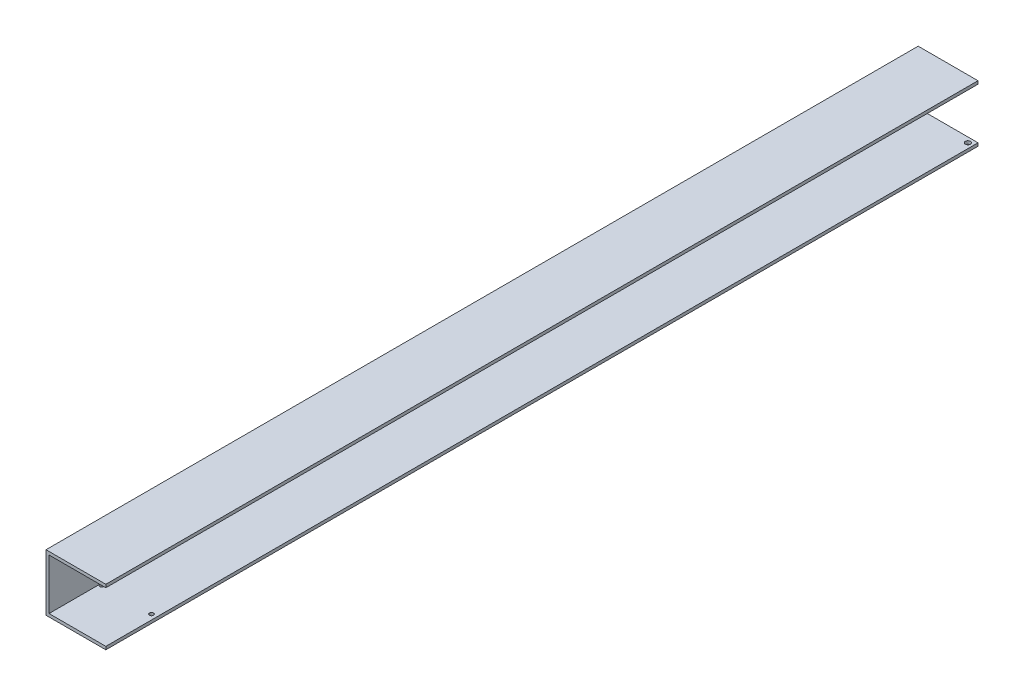
ISO-10303-21;
HEADER;
FILE_DESCRIPTION(('STEP AP214'),'2;1');
FILE_NAME('part.step','',(''),(''),'','','');
FILE_SCHEMA(('AUTOMOTIVE_DESIGN { 1 0 10303 214 1 1 1 1 }'));
ENDSEC;
DATA;
#1=APPLICATION_CONTEXT('core data for automotive mechanical design processes');
#2=APPLICATION_PROTOCOL_DEFINITION('international standard','automotive_design',2000,#1);
#3=PRODUCT_CONTEXT('',#1,'mechanical');
#4=PRODUCT('Part','Part','',(#3));
#5=PRODUCT_RELATED_PRODUCT_CATEGORY('part','',(#4));
#6=PRODUCT_DEFINITION_FORMATION('','',#4);
#7=PRODUCT_DEFINITION_CONTEXT('part definition',#1,'design');
#8=PRODUCT_DEFINITION('design','',#6,#7);
#9=PRODUCT_DEFINITION_SHAPE('','',#8);
#10=(LENGTH_UNIT() NAMED_UNIT(*) SI_UNIT(.MILLI.,.METRE.));
#11=(NAMED_UNIT(*) PLANE_ANGLE_UNIT() SI_UNIT($,.RADIAN.));
#12=(NAMED_UNIT(*) SI_UNIT($,.STERADIAN.) SOLID_ANGLE_UNIT());
#13=UNCERTAINTY_MEASURE_WITH_UNIT(LENGTH_MEASURE(1.E-05),#10,'distance_accuracy_value','');
#14=(GEOMETRIC_REPRESENTATION_CONTEXT(3) GLOBAL_UNCERTAINTY_ASSIGNED_CONTEXT((#13)) GLOBAL_UNIT_ASSIGNED_CONTEXT((#10,
#11,#12)) REPRESENTATION_CONTEXT('',''));
#15=CARTESIAN_POINT('',(0.,0.,0.));
#16=DIRECTION('',(0.,0.,1.));
#17=DIRECTION('',(1.,0.,0.));
#18=AXIS2_PLACEMENT_3D('',#15,#16,#17);
#19=CARTESIAN_POINT('',(-28.,-25.,1005.));
#20=DIRECTION('',(0.,-1.,0.));
#21=DIRECTION('',(0.,0.,-1.));
#22=AXIS2_PLACEMENT_3D('',#19,#20,#21);
#23=PLANE('',#22);
#24=CARTESIAN_POINT('',(23.,-25.,150.));
#25=DIRECTION('',(0.,-1.,0.));
#26=DIRECTION('',(0.,0.,-1.));
#27=AXIS2_PLACEMENT_3D('',#24,#25,#26);
#28=CIRCLE('',#27,2.5);
#29=CARTESIAN_POINT('',(23.,-25.,147.5));
#30=VERTEX_POINT('',#29);
#31=EDGE_CURVE('E173',#30,#30,#28,.T.);
#32=ORIENTED_EDGE('',*,*,#31,.T.);
#33=EDGE_LOOP('',(#32));
#34=FACE_BOUND('',#33,.T.);
#35=CARTESIAN_POINT('',(23.,-25.,955.));
#36=DIRECTION('',(0.,-1.,0.));
#37=DIRECTION('',(0.,0.,-1.));
#38=AXIS2_PLACEMENT_3D('',#35,#36,#37);
#39=CIRCLE('',#38,2.);
#40=CARTESIAN_POINT('',(23.,-25.,953.));
#41=VERTEX_POINT('',#40);
#42=EDGE_CURVE('E199',#41,#41,#39,.T.);
#43=ORIENTED_EDGE('',*,*,#42,.T.);
#44=EDGE_LOOP('',(#43));
#45=FACE_BOUND('',#44,.T.);
#46=DIRECTION('',(0.,0.,-1.));
#47=VECTOR('',#46,1.);
#48=CARTESIAN_POINT('',(28.,-25.,1005.));
#49=LINE('',#48,#47);
#50=CARTESIAN_POINT('',(28.,-25.,1005.));
#51=VERTEX_POINT('',#50);
#52=CARTESIAN_POINT('',(28.,-25.,145.));
#53=VERTEX_POINT('',#52);
#54=EDGE_CURVE('E169',#51,#53,#49,.T.);
#55=ORIENTED_EDGE('',*,*,#54,.T.);
#56=DIRECTION('',(-1.,0.,0.));
#57=VECTOR('',#56,1.);
#58=CARTESIAN_POINT('',(-28.0000000000004,-25.,145.));
#59=LINE('',#58,#57);
#60=CARTESIAN_POINT('',(-28.,-25.,145.));
#61=VERTEX_POINT('',#60);
#62=EDGE_CURVE('E47',#53,#61,#59,.T.);
#63=ORIENTED_EDGE('',*,*,#62,.T.);
#64=DIRECTION('',(0.,0.,-1.));
#65=VECTOR('',#64,1.);
#66=CARTESIAN_POINT('',(-28.,-25.,1005.));
#67=LINE('',#66,#65);
#68=CARTESIAN_POINT('',(-28.,-25.,148.5));
#69=VERTEX_POINT('',#68);
#70=EDGE_CURVE('E147',#69,#61,#67,.T.);
#71=ORIENTED_EDGE('',*,*,#70,.F.);
#72=CARTESIAN_POINT('',(-26.,-25.,150.));
#73=DIRECTION('',(0.,-1.,0.));
#74=DIRECTION('',(0.,0.,-1.));
#75=AXIS2_PLACEMENT_3D('',#72,#73,#74);
#76=CIRCLE('',#75,2.5);
#77=CARTESIAN_POINT('',(-28.,-25.,151.5));
#78=VERTEX_POINT('',#77);
#79=EDGE_CURVE('E166',#69,#78,#76,.T.);
#80=ORIENTED_EDGE('',*,*,#79,.T.);
#81=CARTESIAN_POINT('',(-28.,-25.,955.));
#82=VERTEX_POINT('',#81);
#83=EDGE_CURVE('E149',#82,#78,#67,.T.);
#84=ORIENTED_EDGE('',*,*,#83,.F.);
#85=CARTESIAN_POINT('',(-26.,-25.,955.));
#86=DIRECTION('',(0.,-1.,0.));
#87=DIRECTION('',(0.,0.,-1.));
#88=AXIS2_PLACEMENT_3D('',#85,#86,#87);
#89=CIRCLE('',#88,2.00000000000001);
#90=EDGE_CURVE('E193',#82,#82,#89,.T.);
#91=ORIENTED_EDGE('',*,*,#90,.T.);
#92=CARTESIAN_POINT('',(-28.,-25.,1005.));
#93=VERTEX_POINT('',#92);
#94=EDGE_CURVE('E40',#93,#82,#67,.T.);
#95=ORIENTED_EDGE('',*,*,#94,.F.);
#96=DIRECTION('',(-1.,0.,0.));
#97=VECTOR('',#96,1.);
#98=CARTESIAN_POINT('',(-28.,-25.,1005.));
#99=LINE('',#98,#97);
#100=EDGE_CURVE('E202',#51,#93,#99,.T.);
#101=ORIENTED_EDGE('',*,*,#100,.F.);
#102=EDGE_LOOP('',(#55,#63,#71,#80,#84,#91,#95,#101));
#103=FACE_BOUND('',#102,.T.);
#104=ADVANCED_FACE('F33',(#34,#45,#103),#23,.F.);
#105=CARTESIAN_POINT('',(-28.,25.,1005.));
#106=DIRECTION('',(-1.,0.,0.));
#107=DIRECTION('',(0.,-1.,0.));
#108=AXIS2_PLACEMENT_3D('',#105,#106,#107);
#109=PLANE('',#108);
#110=CARTESIAN_POINT('',(-28.,-7.00000000000001,225.));
#111=DIRECTION('',(-1.,0.,0.));
#112=DIRECTION('',(0.,-1.,0.));
#113=AXIS2_PLACEMENT_3D('',#110,#111,#112);
#114=CIRCLE('',#113,2.50000000000002);
#115=CARTESIAN_POINT('',(-28.,-9.50000000000003,225.));
#116=VERTEX_POINT('',#115);
#117=EDGE_CURVE('E236',#116,#116,#114,.T.);
#118=ORIENTED_EDGE('',*,*,#117,.T.);
#119=EDGE_LOOP('',(#118));
#120=FACE_BOUND('',#119,.T.);
#121=CARTESIAN_POINT('',(-28.,-7.00000000000001,175.));
#122=DIRECTION('',(-1.,0.,0.));
#123=DIRECTION('',(0.,-1.,0.));
#124=AXIS2_PLACEMENT_3D('',#121,#122,#123);
#125=CIRCLE('',#124,2.5);
#126=CARTESIAN_POINT('',(-28.,-9.50000000000001,175.));
#127=VERTEX_POINT('',#126);
#128=EDGE_CURVE('E131',#127,#127,#125,.T.);
#129=ORIENTED_EDGE('',*,*,#128,.T.);
#130=EDGE_LOOP('',(#129));
#131=FACE_BOUND('',#130,.T.);
#132=ORIENTED_EDGE('',*,*,#70,.T.);
#133=DIRECTION('',(0.,1.,0.));
#134=VECTOR('',#133,1.);
#135=CARTESIAN_POINT('',(-28.,25.,145.));
#136=LINE('',#135,#134);
#137=CARTESIAN_POINT('',(-28.,25.,145.));
#138=VERTEX_POINT('',#137);
#139=EDGE_CURVE('E159',#61,#138,#136,.T.);
#140=ORIENTED_EDGE('',*,*,#139,.T.);
#141=DIRECTION('',(0.,0.,-1.));
#142=VECTOR('',#141,1.);
#143=CARTESIAN_POINT('',(-28.,25.,1005.));
#144=LINE('',#143,#142);
#145=CARTESIAN_POINT('',(-28.,25.,1005.));
#146=VERTEX_POINT('',#145);
#147=EDGE_CURVE('E145',#146,#138,#144,.T.);
#148=ORIENTED_EDGE('',*,*,#147,.F.);
#149=DIRECTION('',(0.,1.,0.));
#150=VECTOR('',#149,1.);
#151=CARTESIAN_POINT('',(-28.,25.,1005.));
#152=LINE('',#151,#150);
#153=EDGE_CURVE('E205',#93,#146,#152,.T.);
#154=ORIENTED_EDGE('',*,*,#153,.F.);
#155=ORIENTED_EDGE('',*,*,#94,.T.);
#156=ORIENTED_EDGE('',*,*,#83,.T.);
#157=DIRECTION('',(0.,-1.,0.));
#158=VECTOR('',#157,1.);
#159=CARTESIAN_POINT('',(-28.,22.,151.5));
#160=LINE('',#159,#158);
#161=CARTESIAN_POINT('',(-28.,22.,151.5));
#162=VERTEX_POINT('',#161);
#163=EDGE_CURVE('E183',#78,#162,#160,.F.);
#164=ORIENTED_EDGE('',*,*,#163,.T.);
#165=DIRECTION('',(0.,0.,1.));
#166=VECTOR('',#165,1.);
#167=CARTESIAN_POINT('',(-28.,22.,1005.));
#168=LINE('',#167,#166);
#169=CARTESIAN_POINT('',(-28.,22.,148.5));
#170=VERTEX_POINT('',#169);
#171=EDGE_CURVE('E11',#170,#162,#168,.T.);
#172=ORIENTED_EDGE('',*,*,#171,.F.);
#173=DIRECTION('',(0.,-1.,0.));
#174=VECTOR('',#173,1.);
#175=CARTESIAN_POINT('',(-28.,22.,148.5));
#176=LINE('',#175,#174);
#177=EDGE_CURVE('E161',#170,#69,#176,.T.);
#178=ORIENTED_EDGE('',*,*,#177,.T.);
#179=EDGE_LOOP('',(#132,#140,#148,#154,#155,#156,#164,#172,#178));
#180=FACE_BOUND('',#179,.T.);
#181=ADVANCED_FACE('F157',(#120,#131,#180),#109,.F.);
#182=CARTESIAN_POINT('',(-28.,25.,1005.));
#183=DIRECTION('',(0.,1.,0.));
#184=DIRECTION('',(0.,0.,1.));
#185=AXIS2_PLACEMENT_3D('',#182,#183,#184);
#186=PLANE('',#185);
#187=ORIENTED_EDGE('',*,*,#147,.T.);
#188=DIRECTION('',(1.,0.,0.));
#189=VECTOR('',#188,1.);
#190=CARTESIAN_POINT('',(-28.0000000000004,25.,145.));
#191=LINE('',#190,#189);
#192=CARTESIAN_POINT('',(28.,25.,145.));
#193=VERTEX_POINT('',#192);
#194=EDGE_CURVE('E175',#138,#193,#191,.T.);
#195=ORIENTED_EDGE('',*,*,#194,.T.);
#196=DIRECTION('',(0.,0.,-1.));
#197=VECTOR('',#196,1.);
#198=CARTESIAN_POINT('',(28.,25.,1005.));
#199=LINE('',#198,#197);
#200=CARTESIAN_POINT('',(28.,25.,1005.));
#201=VERTEX_POINT('',#200);
#202=EDGE_CURVE('E137',#201,#193,#199,.T.);
#203=ORIENTED_EDGE('',*,*,#202,.F.);
#204=DIRECTION('',(1.,0.,0.));
#205=VECTOR('',#204,1.);
#206=CARTESIAN_POINT('',(-28.,25.,1005.));
#207=LINE('',#206,#205);
#208=EDGE_CURVE('E207',#146,#201,#207,.T.);
#209=ORIENTED_EDGE('',*,*,#208,.F.);
#210=EDGE_LOOP('',(#187,#195,#203,#209));
#211=FACE_BOUND('',#210,.T.);
#212=ADVANCED_FACE('F258',(#211),#186,.F.);
#213=CARTESIAN_POINT('',(28.,25.,1005.));
#214=DIRECTION('',(-1.,0.,0.));
#215=DIRECTION('',(0.,0.,1.));
#216=AXIS2_PLACEMENT_3D('',#213,#214,#215);
#217=PLANE('',#216);
#218=ORIENTED_EDGE('',*,*,#202,.T.);
#219=DIRECTION('',(0.,1.,0.));
#220=VECTOR('',#219,1.);
#221=CARTESIAN_POINT('',(28.,-35.,145.));
#222=LINE('',#221,#220);
#223=CARTESIAN_POINT('',(28.,28.,145.));
#224=VERTEX_POINT('',#223);
#225=EDGE_CURVE('E120',#193,#224,#222,.T.);
#226=ORIENTED_EDGE('',*,*,#225,.T.);
#227=DIRECTION('',(0.,0.,-1.));
#228=VECTOR('',#227,1.);
#229=CARTESIAN_POINT('',(28.,28.,1005.));
#230=LINE('',#229,#228);
#231=CARTESIAN_POINT('',(28.,28.,1005.));
#232=VERTEX_POINT('',#231);
#233=EDGE_CURVE('E130',#232,#224,#230,.T.);
#234=ORIENTED_EDGE('',*,*,#233,.F.);
#235=DIRECTION('',(0.,1.,0.));
#236=VECTOR('',#235,1.);
#237=CARTESIAN_POINT('',(28.,25.,1005.));
#238=LINE('',#237,#236);
#239=EDGE_CURVE('E209',#201,#232,#238,.T.);
#240=ORIENTED_EDGE('',*,*,#239,.F.);
#241=EDGE_LOOP('',(#218,#226,#234,#240));
#242=FACE_BOUND('',#241,.T.);
#243=ADVANCED_FACE('F264',(#242),#217,.F.);
#244=CARTESIAN_POINT('',(28.,28.,1005.));
#245=DIRECTION('',(0.,-1.,0.));
#246=DIRECTION('',(1.,0.,0.));
#247=AXIS2_PLACEMENT_3D('',#244,#245,#246);
#248=PLANE('',#247);
#249=ORIENTED_EDGE('',*,*,#233,.T.);
#250=DIRECTION('',(1.,0.,0.));
#251=VECTOR('',#250,1.);
#252=CARTESIAN_POINT('',(28.,28.,145.));
#253=LINE('',#252,#251);
#254=CARTESIAN_POINT('',(-31.,28.,145.));
#255=VERTEX_POINT('',#254);
#256=EDGE_CURVE('E112',#255,#224,#253,.T.);
#257=ORIENTED_EDGE('',*,*,#256,.F.);
#258=DIRECTION('',(0.,0.,-1.));
#259=VECTOR('',#258,1.);
#260=CARTESIAN_POINT('',(-31.,28.,1005.));
#261=LINE('',#260,#259);
#262=CARTESIAN_POINT('',(-31.,28.,1005.));
#263=VERTEX_POINT('',#262);
#264=EDGE_CURVE('E127',#263,#255,#261,.T.);
#265=ORIENTED_EDGE('',*,*,#264,.F.);
#266=DIRECTION('',(-1.,0.,0.));
#267=VECTOR('',#266,1.);
#268=CARTESIAN_POINT('',(28.,28.,1005.));
#269=LINE('',#268,#267);
#270=EDGE_CURVE('E211',#232,#263,#269,.T.);
#271=ORIENTED_EDGE('',*,*,#270,.F.);
#272=EDGE_LOOP('',(#249,#257,#265,#271));
#273=FACE_BOUND('',#272,.T.);
#274=ADVANCED_FACE('F125',(#273),#248,.F.);
#275=CARTESIAN_POINT('',(-31.,-28.,1005.));
#276=DIRECTION('',(1.,0.,0.));
#277=DIRECTION('',(0.,0.,-1.));
#278=AXIS2_PLACEMENT_3D('',#275,#276,#277);
#279=PLANE('',#278);
#280=CARTESIAN_POINT('',(-31.,-7.00000000000001,225.));
#281=DIRECTION('',(-1.,0.,0.));
#282=DIRECTION('',(0.,-1.,0.));
#283=AXIS2_PLACEMENT_3D('',#280,#281,#282);
#284=CIRCLE('',#283,2.50000000000002);
#285=CARTESIAN_POINT('',(-31.,-9.50000000000003,225.));
#286=VERTEX_POINT('',#285);
#287=EDGE_CURVE('E239',#286,#286,#284,.T.);
#288=ORIENTED_EDGE('',*,*,#287,.F.);
#289=EDGE_LOOP('',(#288));
#290=FACE_BOUND('',#289,.T.);
#291=CARTESIAN_POINT('',(-31.,-7.00000000000001,175.));
#292=DIRECTION('',(-1.,0.,0.));
#293=DIRECTION('',(0.,-1.,0.));
#294=AXIS2_PLACEMENT_3D('',#291,#292,#293);
#295=CIRCLE('',#294,2.5);
#296=CARTESIAN_POINT('',(-31.,-9.50000000000001,175.));
#297=VERTEX_POINT('',#296);
#298=EDGE_CURVE('E233',#297,#297,#295,.T.);
#299=ORIENTED_EDGE('',*,*,#298,.F.);
#300=EDGE_LOOP('',(#299));
#301=FACE_BOUND('',#300,.T.);
#302=ORIENTED_EDGE('',*,*,#264,.T.);
#303=DIRECTION('',(0.,1.,0.));
#304=VECTOR('',#303,1.);
#305=CARTESIAN_POINT('',(-31.,-35.,145.));
#306=LINE('',#305,#304);
#307=CARTESIAN_POINT('',(-31.,-28.,145.));
#308=VERTEX_POINT('',#307);
#309=EDGE_CURVE('E109',#308,#255,#306,.T.);
#310=ORIENTED_EDGE('',*,*,#309,.F.);
#311=DIRECTION('',(0.,0.,-1.));
#312=VECTOR('',#311,1.);
#313=CARTESIAN_POINT('',(-31.,-28.,1005.));
#314=LINE('',#313,#312);
#315=CARTESIAN_POINT('',(-31.,-28.,1005.));
#316=VERTEX_POINT('',#315);
#317=EDGE_CURVE('E135',#316,#308,#314,.T.);
#318=ORIENTED_EDGE('',*,*,#317,.F.);
#319=DIRECTION('',(0.,-1.,0.));
#320=VECTOR('',#319,1.);
#321=CARTESIAN_POINT('',(-31.,-28.,1005.));
#322=LINE('',#321,#320);
#323=EDGE_CURVE('E134',#263,#316,#322,.T.);
#324=ORIENTED_EDGE('',*,*,#323,.F.);
#325=EDGE_LOOP('',(#302,#310,#318,#324));
#326=FACE_BOUND('',#325,.T.);
#327=ADVANCED_FACE('F133',(#290,#301,#326),#279,.F.);
#328=CARTESIAN_POINT('',(28.,-28.,1005.));
#329=DIRECTION('',(0.,1.,0.));
#330=DIRECTION('',(-1.,0.,0.));
#331=AXIS2_PLACEMENT_3D('',#328,#329,#330);
#332=PLANE('',#331);
#333=CARTESIAN_POINT('',(23.,-28.,150.));
#334=DIRECTION('',(0.,-1.,0.));
#335=DIRECTION('',(1.,0.,0.));
#336=AXIS2_PLACEMENT_3D('',#333,#334,#335);
#337=CIRCLE('',#336,2.5);
#338=CARTESIAN_POINT('',(25.5,-28.,150.));
#339=VERTEX_POINT('',#338);
#340=EDGE_CURVE('E170',#339,#339,#337,.T.);
#341=ORIENTED_EDGE('',*,*,#340,.F.);
#342=EDGE_LOOP('',(#341));
#343=FACE_BOUND('',#342,.T.);
#344=CARTESIAN_POINT('',(-26.,-28.,150.));
#345=DIRECTION('',(0.,-1.,0.));
#346=DIRECTION('',(1.,0.,0.));
#347=AXIS2_PLACEMENT_3D('',#344,#345,#346);
#348=CIRCLE('',#347,2.5);
#349=CARTESIAN_POINT('',(-23.5,-28.,150.));
#350=VERTEX_POINT('',#349);
#351=EDGE_CURVE('E181',#350,#350,#348,.T.);
#352=ORIENTED_EDGE('',*,*,#351,.F.);
#353=EDGE_LOOP('',(#352));
#354=FACE_BOUND('',#353,.T.);
#355=CARTESIAN_POINT('',(-26.,-28.,955.));
#356=DIRECTION('',(0.,-1.,0.));
#357=DIRECTION('',(1.,0.,0.));
#358=AXIS2_PLACEMENT_3D('',#355,#356,#357);
#359=CIRCLE('',#358,2.00000000000001);
#360=CARTESIAN_POINT('',(-24.,-28.,955.));
#361=VERTEX_POINT('',#360);
#362=EDGE_CURVE('E190',#361,#361,#359,.T.);
#363=ORIENTED_EDGE('',*,*,#362,.F.);
#364=EDGE_LOOP('',(#363));
#365=FACE_BOUND('',#364,.T.);
#366=CARTESIAN_POINT('',(23.,-28.,955.));
#367=DIRECTION('',(0.,-1.,0.));
#368=DIRECTION('',(1.,0.,0.));
#369=AXIS2_PLACEMENT_3D('',#366,#367,#368);
#370=CIRCLE('',#369,2.);
#371=CARTESIAN_POINT('',(25.,-28.,955.));
#372=VERTEX_POINT('',#371);
#373=EDGE_CURVE('E196',#372,#372,#370,.T.);
#374=ORIENTED_EDGE('',*,*,#373,.F.);
#375=EDGE_LOOP('',(#374));
#376=FACE_BOUND('',#375,.T.);
#377=ORIENTED_EDGE('',*,*,#317,.T.);
#378=DIRECTION('',(1.,0.,0.));
#379=VECTOR('',#378,1.);
#380=CARTESIAN_POINT('',(27.9999999999996,-28.,145.));
#381=LINE('',#380,#379);
#382=CARTESIAN_POINT('',(28.,-28.,145.));
#383=VERTEX_POINT('',#382);
#384=EDGE_CURVE('E115',#308,#383,#381,.T.);
#385=ORIENTED_EDGE('',*,*,#384,.T.);
#386=DIRECTION('',(0.,0.,-1.));
#387=VECTOR('',#386,1.);
#388=CARTESIAN_POINT('',(28.,-28.,1005.));
#389=LINE('',#388,#387);
#390=CARTESIAN_POINT('',(28.,-28.,1005.));
#391=VERTEX_POINT('',#390);
#392=EDGE_CURVE('E139',#391,#383,#389,.T.);
#393=ORIENTED_EDGE('',*,*,#392,.F.);
#394=DIRECTION('',(1.,0.,0.));
#395=VECTOR('',#394,1.);
#396=CARTESIAN_POINT('',(28.,-28.,1005.));
#397=LINE('',#396,#395);
#398=EDGE_CURVE('E214',#316,#391,#397,.T.);
#399=ORIENTED_EDGE('',*,*,#398,.F.);
#400=EDGE_LOOP('',(#377,#385,#393,#399));
#401=FACE_BOUND('',#400,.T.);
#402=ADVANCED_FACE('F226',(#343,#354,#365,#376,#401),#332,.F.);
#403=CARTESIAN_POINT('',(28.,-25.,1005.));
#404=DIRECTION('',(-1.,0.,0.));
#405=DIRECTION('',(0.,0.,1.));
#406=AXIS2_PLACEMENT_3D('',#403,#404,#405);
#407=PLANE('',#406);
#408=ORIENTED_EDGE('',*,*,#392,.T.);
#409=EDGE_CURVE('E223',#383,#53,#222,.T.);
#410=ORIENTED_EDGE('',*,*,#409,.T.);
#411=ORIENTED_EDGE('',*,*,#54,.F.);
#412=DIRECTION('',(0.,1.,0.));
#413=VECTOR('',#412,1.);
#414=CARTESIAN_POINT('',(28.,-25.,1005.));
#415=LINE('',#414,#413);
#416=EDGE_CURVE('E216',#391,#51,#415,.T.);
#417=ORIENTED_EDGE('',*,*,#416,.F.);
#418=EDGE_LOOP('',(#408,#410,#411,#417));
#419=FACE_BOUND('',#418,.T.);
#420=ADVANCED_FACE('F222',(#419),#407,.F.);
#421=CARTESIAN_POINT('',(0.,0.,1005.));
#422=DIRECTION('',(0.,0.,-1.));
#423=DIRECTION('',(-1.,0.,0.));
#424=AXIS2_PLACEMENT_3D('',#421,#422,#423);
#425=PLANE('',#424);
#426=ORIENTED_EDGE('',*,*,#100,.T.);
#427=ORIENTED_EDGE('',*,*,#153,.T.);
#428=ORIENTED_EDGE('',*,*,#208,.T.);
#429=ORIENTED_EDGE('',*,*,#239,.T.);
#430=ORIENTED_EDGE('',*,*,#270,.T.);
#431=ORIENTED_EDGE('',*,*,#323,.T.);
#432=ORIENTED_EDGE('',*,*,#398,.T.);
#433=ORIENTED_EDGE('',*,*,#416,.T.);
#434=EDGE_LOOP('',(#426,#427,#428,#429,#430,#431,#432,#433));
#435=FACE_BOUND('',#434,.T.);
#436=ADVANCED_FACE('F279',(#435),#425,.F.);
#437=CARTESIAN_POINT('',(23.,22.,955.));
#438=DIRECTION('',(0.,-1.,0.));
#439=DIRECTION('',(1.,0.,0.));
#440=AXIS2_PLACEMENT_3D('',#437,#438,#439);
#441=CYLINDRICAL_SURFACE('',#440,2.);
#442=ORIENTED_EDGE('',*,*,#373,.T.);
#443=EDGE_LOOP('',(#442));
#444=FACE_BOUND('',#443,.T.);
#445=ORIENTED_EDGE('',*,*,#42,.F.);
#446=EDGE_LOOP('',(#445));
#447=FACE_BOUND('',#446,.T.);
#448=ADVANCED_FACE('F282',(#444,#447),#441,.F.);
#449=CARTESIAN_POINT('',(-26.,22.,955.));
#450=DIRECTION('',(0.,-1.,0.));
#451=DIRECTION('',(1.,0.,0.));
#452=AXIS2_PLACEMENT_3D('',#449,#450,#451);
#453=CYLINDRICAL_SURFACE('',#452,2.00000000000001);
#454=ORIENTED_EDGE('',*,*,#362,.T.);
#455=EDGE_LOOP('',(#454));
#456=FACE_BOUND('',#455,.T.);
#457=ORIENTED_EDGE('',*,*,#90,.F.);
#458=EDGE_LOOP('',(#457));
#459=FACE_BOUND('',#458,.T.);
#460=ADVANCED_FACE('F286',(#456,#459),#453,.F.);
#461=CARTESIAN_POINT('',(-26.,22.,150.));
#462=DIRECTION('',(0.,-1.,0.));
#463=DIRECTION('',(1.,0.,0.));
#464=AXIS2_PLACEMENT_3D('',#461,#462,#463);
#465=PLANE('',#464);
#466=ORIENTED_EDGE('',*,*,#171,.T.);
#467=CARTESIAN_POINT('',(-26.,22.,150.));
#468=DIRECTION('',(0.,-1.,0.));
#469=DIRECTION('',(1.,0.,0.));
#470=AXIS2_PLACEMENT_3D('',#467,#468,#469);
#471=CIRCLE('',#470,2.5);
#472=EDGE_CURVE('E53',#162,#170,#471,.T.);
#473=ORIENTED_EDGE('',*,*,#472,.T.);
#474=EDGE_LOOP('',(#466,#473));
#475=FACE_BOUND('',#474,.T.);
#476=ADVANCED_FACE('F290',(#475),#465,.T.);
#477=CARTESIAN_POINT('',(-26.,22.,150.));
#478=DIRECTION('',(0.,-1.,0.));
#479=DIRECTION('',(1.,0.,0.));
#480=AXIS2_PLACEMENT_3D('',#477,#478,#479);
#481=CYLINDRICAL_SURFACE('',#480,2.5);
#482=ORIENTED_EDGE('',*,*,#351,.T.);
#483=EDGE_LOOP('',(#482));
#484=FACE_BOUND('',#483,.T.);
#485=ORIENTED_EDGE('',*,*,#472,.F.);
#486=ORIENTED_EDGE('',*,*,#163,.F.);
#487=ORIENTED_EDGE('',*,*,#79,.F.);
#488=ORIENTED_EDGE('',*,*,#177,.F.);
#489=EDGE_LOOP('',(#485,#486,#487,#488));
#490=FACE_BOUND('',#489,.T.);
#491=ADVANCED_FACE('F292',(#484,#490),#481,.F.);
#492=CARTESIAN_POINT('',(23.,22.,150.));
#493=DIRECTION('',(0.,-1.,0.));
#494=DIRECTION('',(1.,0.,0.));
#495=AXIS2_PLACEMENT_3D('',#492,#493,#494);
#496=CYLINDRICAL_SURFACE('',#495,2.5);
#497=ORIENTED_EDGE('',*,*,#340,.T.);
#498=EDGE_LOOP('',(#497));
#499=FACE_BOUND('',#498,.T.);
#500=ORIENTED_EDGE('',*,*,#31,.F.);
#501=EDGE_LOOP('',(#500));
#502=FACE_BOUND('',#501,.T.);
#503=ADVANCED_FACE('F295',(#499,#502),#496,.F.);
#504=CARTESIAN_POINT('',(28.,-35.,145.));
#505=DIRECTION('',(0.,0.,1.));
#506=DIRECTION('',(1.,0.,0.));
#507=AXIS2_PLACEMENT_3D('',#504,#505,#506);
#508=PLANE('',#507);
#509=ORIENTED_EDGE('',*,*,#409,.F.);
#510=ORIENTED_EDGE('',*,*,#384,.F.);
#511=ORIENTED_EDGE('',*,*,#309,.T.);
#512=ORIENTED_EDGE('',*,*,#256,.T.);
#513=ORIENTED_EDGE('',*,*,#225,.F.);
#514=ORIENTED_EDGE('',*,*,#194,.F.);
#515=ORIENTED_EDGE('',*,*,#139,.F.);
#516=ORIENTED_EDGE('',*,*,#62,.F.);
#517=EDGE_LOOP('',(#509,#510,#511,#512,#513,#514,#515,#516));
#518=FACE_BOUND('',#517,.T.);
#519=ADVANCED_FACE('F111',(#518),#508,.F.);
#520=CARTESIAN_POINT('',(-21.,-7.00000000000001,175.));
#521=DIRECTION('',(-1.,0.,0.));
#522=DIRECTION('',(0.,-1.,0.));
#523=AXIS2_PLACEMENT_3D('',#520,#521,#522);
#524=CYLINDRICAL_SURFACE('',#523,2.5);
#525=ORIENTED_EDGE('',*,*,#298,.T.);
#526=EDGE_LOOP('',(#525));
#527=FACE_BOUND('',#526,.T.);
#528=ORIENTED_EDGE('',*,*,#128,.F.);
#529=EDGE_LOOP('',(#528));
#530=FACE_BOUND('',#529,.T.);
#531=ADVANCED_FACE('F251',(#527,#530),#524,.F.);
#532=CARTESIAN_POINT('',(-21.,-7.00000000000001,225.));
#533=DIRECTION('',(-1.,0.,0.));
#534=DIRECTION('',(0.,-1.,0.));
#535=AXIS2_PLACEMENT_3D('',#532,#533,#534);
#536=CYLINDRICAL_SURFACE('',#535,2.50000000000002);
#537=ORIENTED_EDGE('',*,*,#287,.T.);
#538=EDGE_LOOP('',(#537));
#539=FACE_BOUND('',#538,.T.);
#540=ORIENTED_EDGE('',*,*,#117,.F.);
#541=EDGE_LOOP('',(#540));
#542=FACE_BOUND('',#541,.T.);
#543=ADVANCED_FACE('F243',(#539,#542),#536,.F.);
#544=CLOSED_SHELL('',(#104,#181,#212,#243,#274,#327,#402,#420,#436,#448,#460,#476,#491,#503,
#519,#531,#543));
#545=MANIFOLD_SOLID_BREP('B2',#544);
#546=ADVANCED_BREP_SHAPE_REPRESENTATION('',(#18,#545),#14);
#547=SHAPE_DEFINITION_REPRESENTATION(#9,#546);
ENDSEC;
END-ISO-10303-21;
